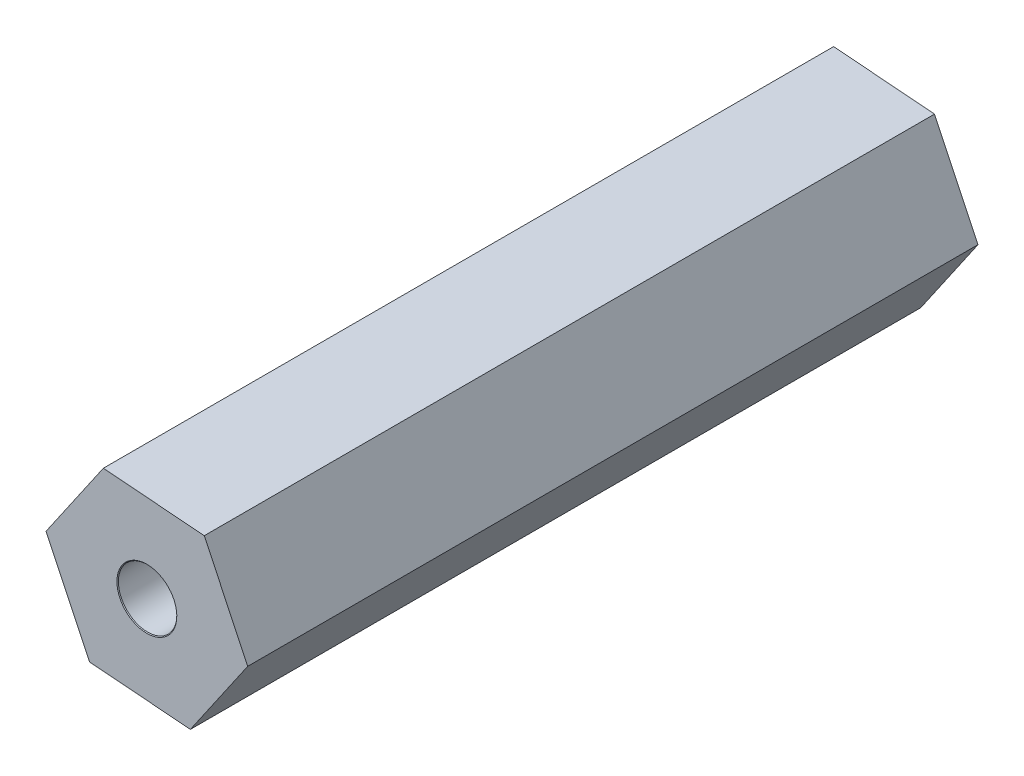
ISO-10303-21;
HEADER;
FILE_DESCRIPTION(('STEP AP214'),'2;1');
FILE_NAME('part.step','',(''),(''),'','','');
FILE_SCHEMA(('AUTOMOTIVE_DESIGN { 1 0 10303 214 1 1 1 1 }'));
ENDSEC;
DATA;
#1=APPLICATION_CONTEXT('core data for automotive mechanical design processes');
#2=APPLICATION_PROTOCOL_DEFINITION('international standard','automotive_design',2000,#1);
#3=PRODUCT_CONTEXT('',#1,'mechanical');
#4=PRODUCT('Part','Part','',(#3));
#5=PRODUCT_RELATED_PRODUCT_CATEGORY('part','',(#4));
#6=PRODUCT_DEFINITION_FORMATION('','',#4);
#7=PRODUCT_DEFINITION_CONTEXT('part definition',#1,'design');
#8=PRODUCT_DEFINITION('design','',#6,#7);
#9=PRODUCT_DEFINITION_SHAPE('','',#8);
#10=(LENGTH_UNIT() NAMED_UNIT(*) SI_UNIT(.MILLI.,.METRE.));
#11=(NAMED_UNIT(*) PLANE_ANGLE_UNIT() SI_UNIT($,.RADIAN.));
#12=(NAMED_UNIT(*) SI_UNIT($,.STERADIAN.) SOLID_ANGLE_UNIT());
#13=UNCERTAINTY_MEASURE_WITH_UNIT(LENGTH_MEASURE(1.E-05),#10,'distance_accuracy_value','');
#14=(GEOMETRIC_REPRESENTATION_CONTEXT(3) GLOBAL_UNCERTAINTY_ASSIGNED_CONTEXT((#13)) GLOBAL_UNIT_ASSIGNED_CONTEXT((#10,
#11,#12)) REPRESENTATION_CONTEXT('',''));
#15=CARTESIAN_POINT('',(0.,0.,0.));
#16=DIRECTION('',(0.,0.,1.));
#17=DIRECTION('',(1.,0.,0.));
#18=AXIS2_PLACEMENT_3D('',#15,#16,#17);
#19=CARTESIAN_POINT('',(0.,0.,0.));
#20=DIRECTION('',(0.,0.,1.));
#21=DIRECTION('',(1.,0.,0.));
#22=AXIS2_PLACEMENT_3D('',#19,#20,#21);
#23=PLANE('',#22);
#24=DIRECTION('',(-0.996853878183202,0.0792612487354969,0.));
#25=VECTOR('',#24,1.);
#26=CARTESIAN_POINT('',(-57.0356146890581,109.853277124668,0.));
#27=LINE('',#26,#25);
#28=CARTESIAN_POINT('',(-57.0356146890581,109.853277124668,0.));
#29=VERTEX_POINT('',#28);
#30=CARTESIAN_POINT('',(-60.4888178185289,110.127846144431,0.));
#31=VERTEX_POINT('',#30);
#32=EDGE_CURVE('E98',#29,#31,#27,.T.);
#33=ORIENTED_EDGE('',*,*,#32,.F.);
#34=DIRECTION('',(-0.429784684150982,0.90293140673544,0.));
#35=VECTOR('',#34,1.);
#36=CARTESIAN_POINT('',(-55.5467968705293,106.725430980238,0.));
#37=LINE('',#36,#35);
#38=CARTESIAN_POINT('',(-55.5467968705293,106.725430980238,0.));
#39=VERTEX_POINT('',#38);
#40=EDGE_CURVE('E120',#39,#29,#37,.T.);
#41=ORIENTED_EDGE('',*,*,#40,.F.);
#42=DIRECTION('',(0.567069194032218,0.823670157999943,0.));
#43=VECTOR('',#42,1.);
#44=CARTESIAN_POINT('',(-57.5111821814711,103.872153855569,0.));
#45=LINE('',#44,#43);
#46=CARTESIAN_POINT('',(-57.5111821814711,103.872153855569,0.));
#47=VERTEX_POINT('',#46);
#48=EDGE_CURVE('E117',#47,#39,#45,.T.);
#49=ORIENTED_EDGE('',*,*,#48,.F.);
#50=DIRECTION('',(0.996853878183202,-0.0792612487354969,0.));
#51=VECTOR('',#50,1.);
#52=CARTESIAN_POINT('',(-60.9643853109419,104.146722875332,0.));
#53=LINE('',#52,#51);
#54=CARTESIAN_POINT('',(-60.9643853109419,104.146722875332,0.));
#55=VERTEX_POINT('',#54);
#56=EDGE_CURVE('E114',#55,#47,#53,.T.);
#57=ORIENTED_EDGE('',*,*,#56,.F.);
#58=DIRECTION('',(0.429784684150985,-0.902931406735439,0.));
#59=VECTOR('',#58,1.);
#60=CARTESIAN_POINT('',(-62.4532031294708,107.274569019762,0.));
#61=LINE('',#60,#59);
#62=CARTESIAN_POINT('',(-62.4532031294708,107.274569019762,0.));
#63=VERTEX_POINT('',#62);
#64=EDGE_CURVE('E101',#63,#55,#61,.T.);
#65=ORIENTED_EDGE('',*,*,#64,.F.);
#66=DIRECTION('',(-0.567069194032218,-0.823670157999943,0.));
#67=VECTOR('',#66,1.);
#68=CARTESIAN_POINT('',(-60.4888178185289,110.127846144431,0.));
#69=LINE('',#68,#67);
#70=EDGE_CURVE('E89',#31,#63,#69,.T.);
#71=ORIENTED_EDGE('',*,*,#70,.F.);
#72=EDGE_LOOP('',(#33,#41,#49,#57,#65,#71));
#73=FACE_BOUND('',#72,.T.);
#74=CARTESIAN_POINT('',(-59.,107.,0.));
#75=DIRECTION('',(0.,0.,1.));
#76=DIRECTION('',(1.,0.,0.));
#77=AXIS2_PLACEMENT_3D('',#74,#75,#76);
#78=CIRCLE('',#77,0.99999999999999);
#79=CARTESIAN_POINT('',(-58.,107.,0.));
#80=VERTEX_POINT('',#79);
#81=EDGE_CURVE('E106',#80,#80,#78,.F.);
#82=ORIENTED_EDGE('',*,*,#81,.F.);
#83=EDGE_LOOP('',(#82));
#84=FACE_BOUND('',#83,.T.);
#85=ADVANCED_FACE('F33',(#73,#84),#23,.F.);
#86=CARTESIAN_POINT('',(-55.5467968705293,106.725430980238,34.3183761153148));
#87=DIRECTION('',(-0.90293140673544,-0.429784684150982,0.));
#88=DIRECTION('',(0.429784684150982,-0.90293140673544,0.));
#89=AXIS2_PLACEMENT_3D('',#86,#87,#88);
#90=PLANE('',#89);
#91=DIRECTION('',(0.,0.,-1.));
#92=VECTOR('',#91,1.);
#93=CARTESIAN_POINT('',(-57.0356146890581,109.853277124668,34.3183761153148));
#94=LINE('',#93,#92);
#95=CARTESIAN_POINT('',(-57.0356146890581,109.853277124668,25.));
#96=VERTEX_POINT('',#95);
#97=EDGE_CURVE('E104',#96,#29,#94,.T.);
#98=ORIENTED_EDGE('',*,*,#97,.F.);
#99=DIRECTION('',(0.429784684150982,-0.90293140673544,0.));
#100=VECTOR('',#99,1.);
#101=CARTESIAN_POINT('',(-55.5467968705293,106.725430980238,25.));
#102=LINE('',#101,#100);
#103=CARTESIAN_POINT('',(-55.5467968705293,106.725430980238,25.));
#104=VERTEX_POINT('',#103);
#105=EDGE_CURVE('E37',#96,#104,#102,.T.);
#106=ORIENTED_EDGE('',*,*,#105,.T.);
#107=DIRECTION('',(0.,0.,-1.));
#108=VECTOR('',#107,1.);
#109=CARTESIAN_POINT('',(-55.5467968705293,106.725430980238,34.3183761153148));
#110=LINE('',#109,#108);
#111=EDGE_CURVE('E123',#104,#39,#110,.T.);
#112=ORIENTED_EDGE('',*,*,#111,.T.);
#113=ORIENTED_EDGE('',*,*,#40,.T.);
#114=EDGE_LOOP('',(#98,#106,#112,#113));
#115=FACE_BOUND('',#114,.T.);
#116=ADVANCED_FACE('F159',(#115),#90,.F.);
#117=CARTESIAN_POINT('',(-57.5111821814711,103.872153855569,34.3183761153148));
#118=DIRECTION('',(-0.823670157999943,0.567069194032218,0.));
#119=DIRECTION('',(-0.567069194032218,-0.823670157999943,0.));
#120=AXIS2_PLACEMENT_3D('',#117,#118,#119);
#121=PLANE('',#120);
#122=ORIENTED_EDGE('',*,*,#111,.F.);
#123=DIRECTION('',(-0.567069194032218,-0.823670157999943,0.));
#124=VECTOR('',#123,1.);
#125=CARTESIAN_POINT('',(-57.5111821814711,103.872153855569,25.));
#126=LINE('',#125,#124);
#127=CARTESIAN_POINT('',(-57.5111821814711,103.872153855569,25.));
#128=VERTEX_POINT('',#127);
#129=EDGE_CURVE('E134',#104,#128,#126,.T.);
#130=ORIENTED_EDGE('',*,*,#129,.T.);
#131=DIRECTION('',(0.,0.,-1.));
#132=VECTOR('',#131,1.);
#133=CARTESIAN_POINT('',(-57.5111821814711,103.872153855569,34.3183761153148));
#134=LINE('',#133,#132);
#135=EDGE_CURVE('E125',#128,#47,#134,.T.);
#136=ORIENTED_EDGE('',*,*,#135,.T.);
#137=ORIENTED_EDGE('',*,*,#48,.T.);
#138=EDGE_LOOP('',(#122,#130,#136,#137));
#139=FACE_BOUND('',#138,.T.);
#140=ADVANCED_FACE('F163',(#139),#121,.F.);
#141=CARTESIAN_POINT('',(-60.9643853109419,104.146722875332,34.3183761153148));
#142=DIRECTION('',(0.0792612487354969,0.996853878183202,0.));
#143=DIRECTION('',(-0.996853878183202,0.0792612487354969,0.));
#144=AXIS2_PLACEMENT_3D('',#141,#142,#143);
#145=PLANE('',#144);
#146=ORIENTED_EDGE('',*,*,#135,.F.);
#147=DIRECTION('',(-0.996853878183202,0.0792612487354969,0.));
#148=VECTOR('',#147,1.);
#149=CARTESIAN_POINT('',(-60.9643853109419,104.146722875332,25.));
#150=LINE('',#149,#148);
#151=CARTESIAN_POINT('',(-60.9643853109419,104.146722875332,25.));
#152=VERTEX_POINT('',#151);
#153=EDGE_CURVE('E132',#128,#152,#150,.T.);
#154=ORIENTED_EDGE('',*,*,#153,.T.);
#155=DIRECTION('',(0.,0.,-1.));
#156=VECTOR('',#155,1.);
#157=CARTESIAN_POINT('',(-60.9643853109419,104.146722875332,34.3183761153148));
#158=LINE('',#157,#156);
#159=EDGE_CURVE('E127',#152,#55,#158,.T.);
#160=ORIENTED_EDGE('',*,*,#159,.T.);
#161=ORIENTED_EDGE('',*,*,#56,.T.);
#162=EDGE_LOOP('',(#146,#154,#160,#161));
#163=FACE_BOUND('',#162,.T.);
#164=ADVANCED_FACE('F169',(#163),#145,.F.);
#165=CARTESIAN_POINT('',(-62.4532031294708,107.274569019762,34.3183761153148));
#166=DIRECTION('',(0.902931406735439,0.429784684150985,0.));
#167=DIRECTION('',(-0.429784684150985,0.902931406735439,0.));
#168=AXIS2_PLACEMENT_3D('',#165,#166,#167);
#169=PLANE('',#168);
#170=ORIENTED_EDGE('',*,*,#159,.F.);
#171=DIRECTION('',(-0.429784684150985,0.902931406735439,0.));
#172=VECTOR('',#171,1.);
#173=CARTESIAN_POINT('',(-62.4532031294708,107.274569019762,25.));
#174=LINE('',#173,#172);
#175=CARTESIAN_POINT('',(-62.4532031294708,107.274569019762,25.));
#176=VERTEX_POINT('',#175);
#177=EDGE_CURVE('E54',#152,#176,#174,.T.);
#178=ORIENTED_EDGE('',*,*,#177,.T.);
#179=DIRECTION('',(0.,0.,-1.));
#180=VECTOR('',#179,1.);
#181=CARTESIAN_POINT('',(-62.4532031294708,107.274569019762,34.3183761153148));
#182=LINE('',#181,#180);
#183=EDGE_CURVE('E93',#176,#63,#182,.T.);
#184=ORIENTED_EDGE('',*,*,#183,.T.);
#185=ORIENTED_EDGE('',*,*,#64,.T.);
#186=EDGE_LOOP('',(#170,#178,#184,#185));
#187=FACE_BOUND('',#186,.T.);
#188=ADVANCED_FACE('F130',(#187),#169,.F.);
#189=CARTESIAN_POINT('',(-60.4888178185289,110.127846144431,34.3183761153148));
#190=DIRECTION('',(0.823670157999943,-0.567069194032218,0.));
#191=DIRECTION('',(0.567069194032218,0.823670157999943,0.));
#192=AXIS2_PLACEMENT_3D('',#189,#190,#191);
#193=PLANE('',#192);
#194=ORIENTED_EDGE('',*,*,#183,.F.);
#195=DIRECTION('',(0.567069194032218,0.823670157999943,0.));
#196=VECTOR('',#195,1.);
#197=CARTESIAN_POINT('',(-60.4888178185289,110.127846144431,25.));
#198=LINE('',#197,#196);
#199=CARTESIAN_POINT('',(-60.4888178185289,110.127846144431,25.));
#200=VERTEX_POINT('',#199);
#201=EDGE_CURVE('E42',#176,#200,#198,.T.);
#202=ORIENTED_EDGE('',*,*,#201,.T.);
#203=DIRECTION('',(0.,0.,-1.));
#204=VECTOR('',#203,1.);
#205=CARTESIAN_POINT('',(-60.4888178185289,110.127846144431,34.3183761153148));
#206=LINE('',#205,#204);
#207=EDGE_CURVE('E86',#200,#31,#206,.T.);
#208=ORIENTED_EDGE('',*,*,#207,.T.);
#209=ORIENTED_EDGE('',*,*,#70,.T.);
#210=EDGE_LOOP('',(#194,#202,#208,#209));
#211=FACE_BOUND('',#210,.T.);
#212=ADVANCED_FACE('F88',(#211),#193,.F.);
#213=CARTESIAN_POINT('',(-57.0356146890581,109.853277124668,34.3183761153148));
#214=DIRECTION('',(-0.0792612487354969,-0.996853878183202,0.));
#215=DIRECTION('',(0.996853878183202,-0.0792612487354969,0.));
#216=AXIS2_PLACEMENT_3D('',#213,#214,#215);
#217=PLANE('',#216);
#218=ORIENTED_EDGE('',*,*,#207,.F.);
#219=DIRECTION('',(0.996853878183202,-0.0792612487354969,0.));
#220=VECTOR('',#219,1.);
#221=CARTESIAN_POINT('',(-57.0356146890581,109.853277124668,25.));
#222=LINE('',#221,#220);
#223=EDGE_CURVE('E11',#200,#96,#222,.T.);
#224=ORIENTED_EDGE('',*,*,#223,.T.);
#225=ORIENTED_EDGE('',*,*,#97,.T.);
#226=ORIENTED_EDGE('',*,*,#32,.T.);
#227=EDGE_LOOP('',(#218,#224,#225,#226));
#228=FACE_BOUND('',#227,.T.);
#229=ADVANCED_FACE('F35',(#228),#217,.F.);
#230=CARTESIAN_POINT('',(0.,0.,25.));
#231=DIRECTION('',(0.,0.,-1.));
#232=DIRECTION('',(-1.,0.,0.));
#233=AXIS2_PLACEMENT_3D('',#230,#231,#232);
#234=PLANE('',#233);
#235=CARTESIAN_POINT('',(-59.,107.,25.));
#236=DIRECTION('',(0.,0.,1.));
#237=DIRECTION('',(0.,-1.,0.));
#238=AXIS2_PLACEMENT_3D('',#235,#236,#237);
#239=CIRCLE('',#238,1.025);
#240=CARTESIAN_POINT('',(-59.,105.975,25.));
#241=VERTEX_POINT('',#240);
#242=EDGE_CURVE('E141',#241,#241,#239,.T.);
#243=ORIENTED_EDGE('',*,*,#242,.F.);
#244=EDGE_LOOP('',(#243));
#245=FACE_BOUND('',#244,.T.);
#246=ORIENTED_EDGE('',*,*,#201,.F.);
#247=ORIENTED_EDGE('',*,*,#177,.F.);
#248=ORIENTED_EDGE('',*,*,#153,.F.);
#249=ORIENTED_EDGE('',*,*,#129,.F.);
#250=ORIENTED_EDGE('',*,*,#105,.F.);
#251=ORIENTED_EDGE('',*,*,#223,.F.);
#252=EDGE_LOOP('',(#246,#247,#248,#249,#250,#251));
#253=FACE_BOUND('',#252,.T.);
#254=ADVANCED_FACE('F147',(#245,#253),#234,.F.);
#255=CARTESIAN_POINT('',(-59.,107.,25.));
#256=DIRECTION('',(0.,0.,1.));
#257=DIRECTION('',(0.,-1.,0.));
#258=AXIS2_PLACEMENT_3D('',#255,#256,#257);
#259=CYLINDRICAL_SURFACE('',#258,0.99999999999999);
#260=ORIENTED_EDGE('',*,*,#81,.T.);
#261=EDGE_LOOP('',(#260));
#262=FACE_BOUND('',#261,.T.);
#263=CARTESIAN_POINT('',(-59.,107.,24.975));
#264=DIRECTION('',(0.,0.,1.));
#265=DIRECTION('',(0.,-1.,0.));
#266=AXIS2_PLACEMENT_3D('',#263,#264,#265);
#267=CIRCLE('',#266,0.999999999999987);
#268=CARTESIAN_POINT('',(-59.,106.,24.975));
#269=VERTEX_POINT('',#268);
#270=EDGE_CURVE('E109',#269,#269,#267,.T.);
#271=ORIENTED_EDGE('',*,*,#270,.T.);
#272=EDGE_LOOP('',(#271));
#273=FACE_BOUND('',#272,.T.);
#274=ADVANCED_FACE('F149',(#262,#273),#259,.F.);
#275=CARTESIAN_POINT('',(-59.,107.,25.));
#276=DIRECTION('',(0.,0.,1.));
#277=DIRECTION('',(0.,-1.,0.));
#278=AXIS2_PLACEMENT_3D('',#275,#276,#277);
#279=CONICAL_SURFACE('',#278,1.025,0.785398163397379);
#280=ORIENTED_EDGE('',*,*,#270,.F.);
#281=EDGE_LOOP('',(#280));
#282=FACE_BOUND('',#281,.T.);
#283=ORIENTED_EDGE('',*,*,#242,.T.);
#284=EDGE_LOOP('',(#283));
#285=FACE_BOUND('',#284,.T.);
#286=ADVANCED_FACE('F145',(#282,#285),#279,.F.);
#287=CLOSED_SHELL('',(#85,#116,#140,#164,#188,#212,#229,#254,#274,#286));
#288=MANIFOLD_SOLID_BREP('B2',#287);
#289=ADVANCED_BREP_SHAPE_REPRESENTATION('',(#18,#288),#14);
#290=SHAPE_DEFINITION_REPRESENTATION(#9,#289);
ENDSEC;
END-ISO-10303-21;
